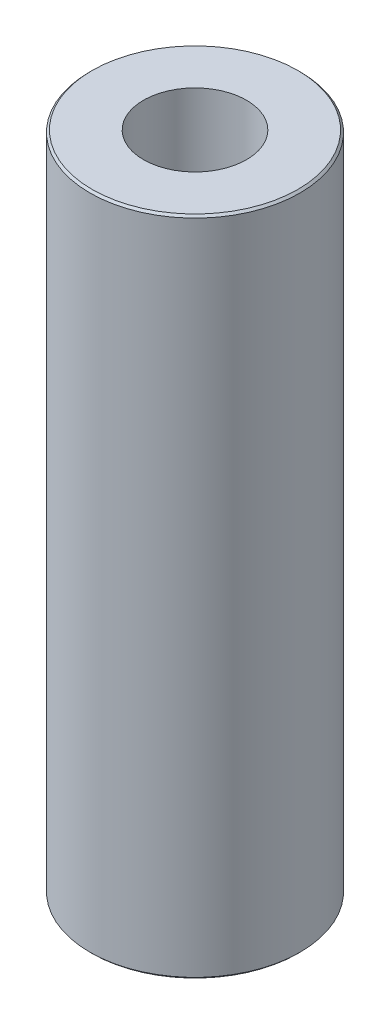
ISO-10303-21;
HEADER;
FILE_DESCRIPTION(('STEP AP214'),'2;1');
FILE_NAME('part.step','',(''),(''),'','','');
FILE_SCHEMA(('AUTOMOTIVE_DESIGN { 1 0 10303 214 1 1 1 1 }'));
ENDSEC;
DATA;
#1=APPLICATION_CONTEXT('core data for automotive mechanical design processes');
#2=APPLICATION_PROTOCOL_DEFINITION('international standard','automotive_design',2000,#1);
#3=PRODUCT_CONTEXT('',#1,'mechanical');
#4=PRODUCT('Part','Part','',(#3));
#5=PRODUCT_RELATED_PRODUCT_CATEGORY('part','',(#4));
#6=PRODUCT_DEFINITION_FORMATION('','',#4);
#7=PRODUCT_DEFINITION_CONTEXT('part definition',#1,'design');
#8=PRODUCT_DEFINITION('design','',#6,#7);
#9=PRODUCT_DEFINITION_SHAPE('','',#8);
#10=(LENGTH_UNIT() NAMED_UNIT(*) SI_UNIT(.MILLI.,.METRE.));
#11=(NAMED_UNIT(*) PLANE_ANGLE_UNIT() SI_UNIT($,.RADIAN.));
#12=(NAMED_UNIT(*) SI_UNIT($,.STERADIAN.) SOLID_ANGLE_UNIT());
#13=UNCERTAINTY_MEASURE_WITH_UNIT(LENGTH_MEASURE(1.E-05),#10,'distance_accuracy_value','');
#14=(GEOMETRIC_REPRESENTATION_CONTEXT(3) GLOBAL_UNCERTAINTY_ASSIGNED_CONTEXT((#13)) GLOBAL_UNIT_ASSIGNED_CONTEXT((#10,
#11,#12)) REPRESENTATION_CONTEXT('',''));
#15=CARTESIAN_POINT('',(0.,0.,0.));
#16=DIRECTION('',(0.,0.,1.));
#17=DIRECTION('',(1.,0.,0.));
#18=AXIS2_PLACEMENT_3D('',#15,#16,#17);
#19=CARTESIAN_POINT('',(0.,314.974010067568,0.));
#20=DIRECTION('',(0.,-1.,0.));
#21=DIRECTION('',(0.,0.,-1.));
#22=AXIS2_PLACEMENT_3D('',#19,#20,#21);
#23=CYLINDRICAL_SURFACE('',#22,50.);
#24=CARTESIAN_POINT('',(0.,313.979703279679,0.));
#25=DIRECTION('',(0.,1.,0.));
#26=DIRECTION('',(0.,0.,1.));
#27=AXIS2_PLACEMENT_3D('',#24,#25,#26);
#28=CIRCLE('',#27,50.);
#29=CARTESIAN_POINT('',(0.,313.979703279679,50.));
#30=VERTEX_POINT('',#29);
#31=EDGE_CURVE('E50',#30,#30,#28,.F.);
#32=ORIENTED_EDGE('',*,*,#31,.T.);
#33=EDGE_LOOP('',(#32));
#34=FACE_BOUND('',#33,.T.);
#35=CARTESIAN_POINT('',(0.,0.994306787888644,0.));
#36=DIRECTION('',(0.,1.,0.));
#37=DIRECTION('',(0.,0.,1.));
#38=AXIS2_PLACEMENT_3D('',#35,#36,#37);
#39=CIRCLE('',#38,50.);
#40=CARTESIAN_POINT('',(0.,0.994306787888644,50.));
#41=VERTEX_POINT('',#40);
#42=EDGE_CURVE('E51',#41,#41,#39,.T.);
#43=ORIENTED_EDGE('',*,*,#42,.T.);
#44=EDGE_LOOP('',(#43));
#45=FACE_BOUND('',#44,.T.);
#46=ADVANCED_FACE('F39',(#34,#45),#23,.T.);
#47=CARTESIAN_POINT('',(0.,314.974010067568,0.));
#48=DIRECTION('',(0.,1.,0.));
#49=DIRECTION('',(0.,0.,1.));
#50=AXIS2_PLACEMENT_3D('',#47,#48,#49);
#51=PLANE('',#50);
#52=CARTESIAN_POINT('',(0.,314.974010067568,0.));
#53=DIRECTION('',(0.,1.,0.));
#54=DIRECTION('',(0.,0.,1.));
#55=AXIS2_PLACEMENT_3D('',#52,#53,#54);
#56=CIRCLE('',#55,49.0056932121113);
#57=CARTESIAN_POINT('',(0.,314.974010067568,49.0056932121113));
#58=VERTEX_POINT('',#57);
#59=EDGE_CURVE('E54',#58,#58,#56,.T.);
#60=ORIENTED_EDGE('',*,*,#59,.T.);
#61=EDGE_LOOP('',(#60));
#62=FACE_BOUND('',#61,.T.);
#63=CARTESIAN_POINT('',(0.,314.974010067568,0.));
#64=DIRECTION('',(0.,1.,0.));
#65=DIRECTION('',(0.,0.,1.));
#66=AXIS2_PLACEMENT_3D('',#63,#64,#65);
#67=CIRCLE('',#66,24.5269257881602);
#68=CARTESIAN_POINT('',(0.,314.974010067568,24.5269257881602));
#69=VERTEX_POINT('',#68);
#70=EDGE_CURVE('E58',#69,#69,#67,.T.);
#71=ORIENTED_EDGE('',*,*,#70,.F.);
#72=EDGE_LOOP('',(#71));
#73=FACE_BOUND('',#72,.T.);
#74=ADVANCED_FACE('F69',(#62,#73),#51,.T.);
#75=CARTESIAN_POINT('',(0.,0.,0.));
#76=DIRECTION('',(0.,1.,0.));
#77=DIRECTION('',(0.,0.,1.));
#78=AXIS2_PLACEMENT_3D('',#75,#76,#77);
#79=PLANE('',#78);
#80=CARTESIAN_POINT('',(0.,0.,0.));
#81=DIRECTION('',(0.,1.,0.));
#82=DIRECTION('',(0.,0.,1.));
#83=AXIS2_PLACEMENT_3D('',#80,#81,#82);
#84=CIRCLE('',#83,49.0056932121114);
#85=CARTESIAN_POINT('',(0.,0.,49.0056932121114));
#86=VERTEX_POINT('',#85);
#87=EDGE_CURVE('E10',#86,#86,#84,.F.);
#88=ORIENTED_EDGE('',*,*,#87,.T.);
#89=EDGE_LOOP('',(#88));
#90=FACE_BOUND('',#89,.T.);
#91=CARTESIAN_POINT('',(0.,0.,0.));
#92=DIRECTION('',(0.,1.,0.));
#93=DIRECTION('',(0.,0.,1.));
#94=AXIS2_PLACEMENT_3D('',#91,#92,#93);
#95=CIRCLE('',#94,24.5269257881602);
#96=CARTESIAN_POINT('',(0.,0.,24.5269257881602));
#97=VERTEX_POINT('',#96);
#98=EDGE_CURVE('E63',#97,#97,#95,.T.);
#99=ORIENTED_EDGE('',*,*,#98,.T.);
#100=EDGE_LOOP('',(#99));
#101=FACE_BOUND('',#100,.T.);
#102=ADVANCED_FACE('F75',(#90,#101),#79,.F.);
#103=CARTESIAN_POINT('',(0.,314.974010067568,0.));
#104=DIRECTION('',(0.,-1.,0.));
#105=DIRECTION('',(0.,0.,-1.));
#106=AXIS2_PLACEMENT_3D('',#103,#104,#105);
#107=CYLINDRICAL_SURFACE('',#106,24.5269257881602);
#108=ORIENTED_EDGE('',*,*,#70,.T.);
#109=EDGE_LOOP('',(#108));
#110=FACE_BOUND('',#109,.T.);
#111=ORIENTED_EDGE('',*,*,#98,.F.);
#112=EDGE_LOOP('',(#111));
#113=FACE_BOUND('',#112,.T.);
#114=ADVANCED_FACE('F70',(#110,#113),#107,.F.);
#115=CARTESIAN_POINT('',(0.,314.974010067568,0.));
#116=DIRECTION('',(0.,-1.,0.));
#117=DIRECTION('',(0.,0.,-1.));
#118=AXIS2_PLACEMENT_3D('',#115,#116,#117);
#119=CONICAL_SURFACE('',#118,49.0056932121113,0.785398163397427);
#120=ORIENTED_EDGE('',*,*,#31,.F.);
#121=EDGE_LOOP('',(#120));
#122=FACE_BOUND('',#121,.T.);
#123=ORIENTED_EDGE('',*,*,#59,.F.);
#124=EDGE_LOOP('',(#123));
#125=FACE_BOUND('',#124,.T.);
#126=ADVANCED_FACE('F81',(#122,#125),#119,.T.);
#127=CARTESIAN_POINT('',(0.,0.994306787888644,0.));
#128=DIRECTION('',(0.,1.,0.));
#129=DIRECTION('',(0.,0.,1.));
#130=AXIS2_PLACEMENT_3D('',#127,#128,#129);
#131=CONICAL_SURFACE('',#130,50.,0.785398163397438);
#132=ORIENTED_EDGE('',*,*,#87,.F.);
#133=EDGE_LOOP('',(#132));
#134=FACE_BOUND('',#133,.T.);
#135=ORIENTED_EDGE('',*,*,#42,.F.);
#136=EDGE_LOOP('',(#135));
#137=FACE_BOUND('',#136,.T.);
#138=ADVANCED_FACE('F45',(#134,#137),#131,.T.);
#139=CLOSED_SHELL('',(#46,#74,#102,#114,#126,#138));
#140=MANIFOLD_SOLID_BREP('B2',#139);
#141=ADVANCED_BREP_SHAPE_REPRESENTATION('',(#18,#140),#14);
#142=SHAPE_DEFINITION_REPRESENTATION(#9,#141);
ENDSEC;
END-ISO-10303-21;
